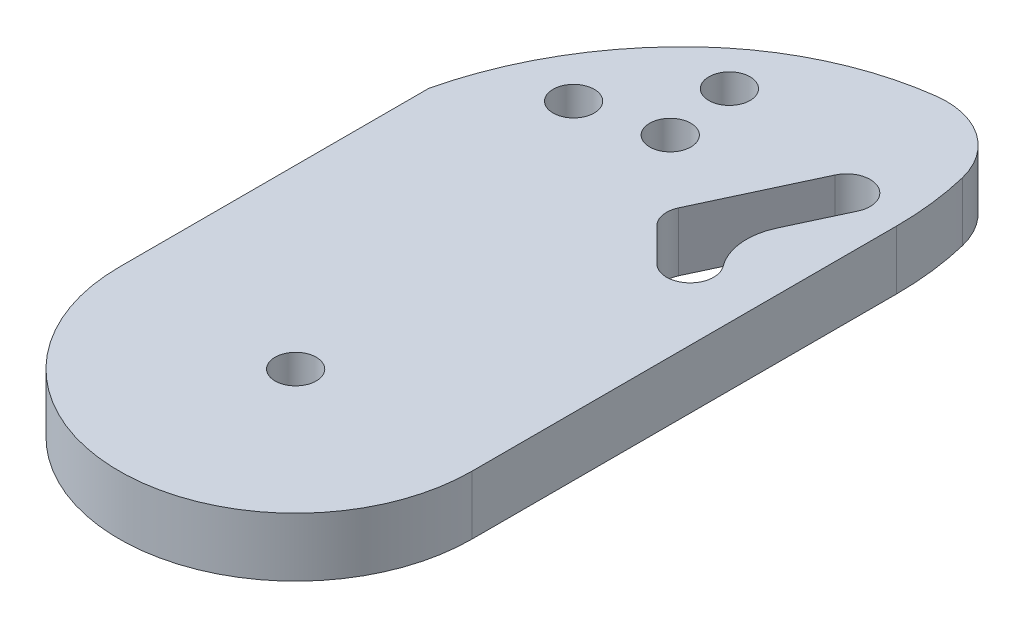
ISO-10303-21;
HEADER;
FILE_DESCRIPTION(('STEP AP214'),'2;1');
FILE_NAME('part.step','',(''),(''),'','','');
FILE_SCHEMA(('AUTOMOTIVE_DESIGN { 1 0 10303 214 1 1 1 1 }'));
ENDSEC;
DATA;
#1=APPLICATION_CONTEXT('core data for automotive mechanical design processes');
#2=APPLICATION_PROTOCOL_DEFINITION('international standard','automotive_design',2000,#1);
#3=PRODUCT_CONTEXT('',#1,'mechanical');
#4=PRODUCT('Part','Part','',(#3));
#5=PRODUCT_RELATED_PRODUCT_CATEGORY('part','',(#4));
#6=PRODUCT_DEFINITION_FORMATION('','',#4);
#7=PRODUCT_DEFINITION_CONTEXT('part definition',#1,'design');
#8=PRODUCT_DEFINITION('design','',#6,#7);
#9=PRODUCT_DEFINITION_SHAPE('','',#8);
#10=(LENGTH_UNIT() NAMED_UNIT(*) SI_UNIT(.MILLI.,.METRE.));
#11=(NAMED_UNIT(*) PLANE_ANGLE_UNIT() SI_UNIT($,.RADIAN.));
#12=(NAMED_UNIT(*) SI_UNIT($,.STERADIAN.) SOLID_ANGLE_UNIT());
#13=UNCERTAINTY_MEASURE_WITH_UNIT(LENGTH_MEASURE(1.E-05),#10,'distance_accuracy_value','');
#14=(GEOMETRIC_REPRESENTATION_CONTEXT(3) GLOBAL_UNCERTAINTY_ASSIGNED_CONTEXT((#13)) GLOBAL_UNIT_ASSIGNED_CONTEXT((#10,
#11,#12)) REPRESENTATION_CONTEXT('',''));
#15=CARTESIAN_POINT('',(0.,0.,0.));
#16=DIRECTION('',(0.,0.,1.));
#17=DIRECTION('',(1.,0.,0.));
#18=AXIS2_PLACEMENT_3D('',#15,#16,#17);
#19=CARTESIAN_POINT('',(0.,5.,0.));
#20=DIRECTION('',(0.,1.,0.));
#21=DIRECTION('',(0.,0.,1.));
#22=AXIS2_PLACEMENT_3D('',#19,#20,#21);
#23=PLANE('',#22);
#24=CARTESIAN_POINT('',(-7.90591950617081,5.,-31.5197648568308));
#25=DIRECTION('',(0.,1.,0.));
#26=DIRECTION('',(0.,0.,1.));
#27=AXIS2_PLACEMENT_3D('',#24,#25,#26);
#28=CIRCLE('',#27,1.75);
#29=CARTESIAN_POINT('',(-7.90591950617081,5.,-29.7697648568308));
#30=VERTEX_POINT('',#29);
#31=EDGE_CURVE('E357',#30,#30,#28,.T.);
#32=ORIENTED_EDGE('',*,*,#31,.F.);
#33=EDGE_LOOP('',(#32));
#34=FACE_BOUND('',#33,.T.);
#35=CARTESIAN_POINT('',(-2.20712771461398,5.,-39.0574093951377));
#36=DIRECTION('',(0.,1.,0.));
#37=DIRECTION('',(0.,0.,1.));
#38=AXIS2_PLACEMENT_3D('',#35,#36,#37);
#39=CIRCLE('',#38,1.75);
#40=CARTESIAN_POINT('',(-2.20712771461398,5.,-37.3074093951377));
#41=VERTEX_POINT('',#40);
#42=EDGE_CURVE('E356',#41,#41,#39,.T.);
#43=ORIENTED_EDGE('',*,*,#42,.F.);
#44=EDGE_LOOP('',(#43));
#45=FACE_BOUND('',#44,.T.);
#46=CARTESIAN_POINT('',(-1.30177895180411,5.,-33.1261073780694));
#47=DIRECTION('',(0.,1.,0.));
#48=DIRECTION('',(0.,0.,1.));
#49=AXIS2_PLACEMENT_3D('',#46,#47,#48);
#50=CIRCLE('',#49,1.75);
#51=CARTESIAN_POINT('',(-1.30177895180411,5.,-31.3761073780694));
#52=VERTEX_POINT('',#51);
#53=EDGE_CURVE('E241',#52,#52,#50,.T.);
#54=ORIENTED_EDGE('',*,*,#53,.F.);
#55=EDGE_LOOP('',(#54));
#56=FACE_BOUND('',#55,.T.);
#57=CARTESIAN_POINT('',(0.,5.,0.));
#58=DIRECTION('',(0.,1.,0.));
#59=DIRECTION('',(0.,0.,1.));
#60=AXIS2_PLACEMENT_3D('',#57,#58,#59);
#61=CIRCLE('',#60,1.75);
#62=CARTESIAN_POINT('',(0.,5.,1.75));
#63=VERTEX_POINT('',#62);
#64=EDGE_CURVE('E171',#63,#63,#61,.T.);
#65=ORIENTED_EDGE('',*,*,#64,.F.);
#66=EDGE_LOOP('',(#65));
#67=FACE_BOUND('',#66,.T.);
#68=DIRECTION('',(-0.422618261740694,0.,0.906307787036653));
#69=VECTOR('',#68,1.);
#70=CARTESIAN_POINT('',(-3.53250443703335,5.,-1.64723387145513));
#71=LINE('',#70,#69);
#72=CARTESIAN_POINT('',(12.2577304500981,5.,-35.5095018633806));
#73=VERTEX_POINT('',#72);
#74=CARTESIAN_POINT('',(10.0710728323983,5.,-30.8201994694383));
#75=VERTEX_POINT('',#74);
#76=EDGE_CURVE('E176',#73,#75,#71,.T.);
#77=ORIENTED_EDGE('',*,*,#76,.T.);
#78=CARTESIAN_POINT('',(14.6026117675815,5.,-28.7071081607348));
#79=DIRECTION('',(0.,1.,0.));
#80=DIRECTION('',(0.,0.,1.));
#81=AXIS2_PLACEMENT_3D('',#78,#79,#80);
#82=CIRCLE('',#81,5.);
#83=CARTESIAN_POINT('',(10.600746219309,5.,-25.7095971710052));
#84=VERTEX_POINT('',#83);
#85=EDGE_CURVE('E228',#75,#84,#82,.T.);
#86=ORIENTED_EDGE('',*,*,#85,.T.);
#87=CARTESIAN_POINT('',(9.,5.,-24.5105927751134));
#88=DIRECTION('',(0.,1.,0.));
#89=DIRECTION('',(0.,0.,1.));
#90=AXIS2_PLACEMENT_3D('',#87,#88,#89);
#91=CIRCLE('',#90,2.);
#92=CARTESIAN_POINT('',(7.58578643762692,5.,-23.0963792127403));
#93=VERTEX_POINT('',#92);
#94=EDGE_CURVE('E208',#93,#84,#91,.T.);
#95=ORIENTED_EDGE('',*,*,#94,.F.);
#96=DIRECTION('',(0.707106781186554,0.,0.707106781186541));
#97=VECTOR('',#96,1.);
#98=CARTESIAN_POINT('',(15.3410828251835,5.,-15.3410828251838));
#99=LINE('',#98,#97);
#100=CARTESIAN_POINT('',(4.8047186962448,5.,-25.8774469541224));
#101=VERTEX_POINT('',#100);
#102=EDGE_CURVE('E319',#101,#93,#99,.T.);
#103=ORIENTED_EDGE('',*,*,#102,.F.);
#104=CARTESIAN_POINT('',(6.21893225861788,5.,-27.2916605164955));
#105=DIRECTION('',(0.,1.,0.));
#106=DIRECTION('',(0.,0.,1.));
#107=AXIS2_PLACEMENT_3D('',#104,#105,#106);
#108=CIRCLE('',#107,2.);
#109=CARTESIAN_POINT('',(4.40631668454458,5.,-28.1368970399769));
#110=VERTEX_POINT('',#109);
#111=EDGE_CURVE('E338',#110,#101,#108,.T.);
#112=ORIENTED_EDGE('',*,*,#111,.F.);
#113=DIRECTION('',(-0.422618261740694,0.,0.906307787036652));
#114=VECTOR('',#113,1.);
#115=CARTESIAN_POINT('',(-7.15773558517998,5.,-3.33770691841793));
#116=LINE('',#115,#114);
#117=CARTESIAN_POINT('',(8.63249930195152,5.,-37.1999749103434));
#118=VERTEX_POINT('',#117);
#119=EDGE_CURVE('E334',#118,#110,#116,.T.);
#120=ORIENTED_EDGE('',*,*,#119,.F.);
#121=CARTESIAN_POINT('',(10.4451148760249,5.,-36.354738386862));
#122=DIRECTION('',(0.,1.,0.));
#123=DIRECTION('',(0.,0.,1.));
#124=AXIS2_PLACEMENT_3D('',#121,#122,#123);
#125=CIRCLE('',#124,2.);
#126=EDGE_CURVE('E329',#73,#118,#125,.T.);
#127=ORIENTED_EDGE('',*,*,#126,.F.);
#128=EDGE_LOOP('',(#77,#86,#95,#103,#112,#120,#127));
#129=FACE_BOUND('',#128,.T.);
#130=CARTESIAN_POINT('',(-12.0433926946577,5.,-36.0469907387137));
#131=DIRECTION('',(0.,-1.,0.));
#132=DIRECTION('',(0.,0.,1.));
#133=AXIS2_PLACEMENT_3D('',#130,#131,#132);
#134=CIRCLE('',#133,27.0433926946577);
#135=CARTESIAN_POINT('',(14.2432435242057,5.,-42.3997731790783));
#136=VERTEX_POINT('',#135);
#137=CARTESIAN_POINT('',(15.,5.,-36.0469907387136));
#138=VERTEX_POINT('',#137);
#139=EDGE_CURVE('E143',#136,#138,#134,.T.);
#140=ORIENTED_EDGE('',*,*,#139,.F.);
#141=CARTESIAN_POINT('',(7.95930078320732,5.,-40.8811109672649));
#142=DIRECTION('',(0.,-1.,0.));
#143=DIRECTION('',(0.,0.,1.));
#144=AXIS2_PLACEMENT_3D('',#141,#142,#143);
#145=CIRCLE('',#144,6.46484889890984);
#146=CARTESIAN_POINT('',(7.1270724023176,5.,-47.2921691644565));
#147=VERTEX_POINT('',#146);
#148=EDGE_CURVE('E164',#147,#136,#145,.T.);
#149=ORIENTED_EDGE('',*,*,#148,.F.);
#150=CARTESIAN_POINT('',(10.3077401020891,5.,-22.789945739485));
#151=DIRECTION('',(0.,-1.,0.));
#152=DIRECTION('',(0.,0.,1.));
#153=AXIS2_PLACEMENT_3D('',#150,#151,#152);
#154=CIRCLE('',#153,24.707804430657);
#155=CARTESIAN_POINT('',(-6.48402665532397,5.,-40.9148503998751));
#156=VERTEX_POINT('',#155);
#157=EDGE_CURVE('E350',#156,#147,#154,.T.);
#158=ORIENTED_EDGE('',*,*,#157,.F.);
#159=CARTESIAN_POINT('',(13.2458473139737,5.,-19.6185752775946));
#160=DIRECTION('',(0.,-1.,0.));
#161=DIRECTION('',(0.,0.,1.));
#162=AXIS2_PLACEMENT_3D('',#159,#160,#161);
#163=CIRCLE('',#162,29.0310051656541);
#164=CARTESIAN_POINT('',(-15.,5.,-26.3246449494605));
#165=VERTEX_POINT('',#164);
#166=EDGE_CURVE('E153',#165,#156,#163,.T.);
#167=ORIENTED_EDGE('',*,*,#166,.F.);
#168=DIRECTION('',(0.,0.,-1.));
#169=VECTOR('',#168,1.);
#170=CARTESIAN_POINT('',(-15.,5.,0.));
#171=LINE('',#170,#169);
#172=CARTESIAN_POINT('',(-15.,5.,0.));
#173=VERTEX_POINT('',#172);
#174=EDGE_CURVE('E170',#173,#165,#171,.T.);
#175=ORIENTED_EDGE('',*,*,#174,.F.);
#176=CARTESIAN_POINT('',(0.,5.,0.));
#177=DIRECTION('',(0.,1.,0.));
#178=DIRECTION('',(0.,0.,1.));
#179=AXIS2_PLACEMENT_3D('',#176,#177,#178);
#180=CIRCLE('',#179,15.);
#181=CARTESIAN_POINT('',(15.,5.,0.));
#182=VERTEX_POINT('',#181);
#183=EDGE_CURVE('E168',#173,#182,#180,.T.);
#184=ORIENTED_EDGE('',*,*,#183,.T.);
#185=DIRECTION('',(0.,0.,-1.));
#186=VECTOR('',#185,1.);
#187=CARTESIAN_POINT('',(15.,5.,0.));
#188=LINE('',#187,#186);
#189=EDGE_CURVE('E160',#182,#138,#188,.T.);
#190=ORIENTED_EDGE('',*,*,#189,.T.);
#191=EDGE_LOOP('',(#140,#149,#158,#167,#175,#184,#190));
#192=FACE_BOUND('',#191,.T.);
#193=ADVANCED_FACE('F39',(#34,#45,#56,#67,#129,#192),#23,.T.);
#194=CARTESIAN_POINT('',(0.,0.,0.));
#195=DIRECTION('',(0.,1.,0.));
#196=DIRECTION('',(0.,0.,1.));
#197=AXIS2_PLACEMENT_3D('',#194,#195,#196);
#198=PLANE('',#197);
#199=CARTESIAN_POINT('',(-7.90591950617081,0.,-31.5197648568308));
#200=DIRECTION('',(0.,1.,0.));
#201=DIRECTION('',(0.,0.,1.));
#202=AXIS2_PLACEMENT_3D('',#199,#200,#201);
#203=CIRCLE('',#202,1.75);
#204=CARTESIAN_POINT('',(-7.90591950617081,0.,-29.7697648568308));
#205=VERTEX_POINT('',#204);
#206=EDGE_CURVE('E43',#205,#205,#203,.T.);
#207=ORIENTED_EDGE('',*,*,#206,.T.);
#208=EDGE_LOOP('',(#207));
#209=FACE_BOUND('',#208,.T.);
#210=CARTESIAN_POINT('',(-2.20712771461398,0.,-39.0574093951377));
#211=DIRECTION('',(0.,1.,0.));
#212=DIRECTION('',(0.,0.,1.));
#213=AXIS2_PLACEMENT_3D('',#210,#211,#212);
#214=CIRCLE('',#213,1.75);
#215=CARTESIAN_POINT('',(-2.20712771461398,0.,-37.3074093951377));
#216=VERTEX_POINT('',#215);
#217=EDGE_CURVE('E240',#216,#216,#214,.T.);
#218=ORIENTED_EDGE('',*,*,#217,.T.);
#219=EDGE_LOOP('',(#218));
#220=FACE_BOUND('',#219,.T.);
#221=CARTESIAN_POINT('',(-1.30177895180411,0.,-33.1261073780694));
#222=DIRECTION('',(0.,1.,0.));
#223=DIRECTION('',(0.,0.,1.));
#224=AXIS2_PLACEMENT_3D('',#221,#222,#223);
#225=CIRCLE('',#224,1.75);
#226=CARTESIAN_POINT('',(-1.30177895180411,0.,-31.3761073780694));
#227=VERTEX_POINT('',#226);
#228=EDGE_CURVE('E238',#227,#227,#225,.T.);
#229=ORIENTED_EDGE('',*,*,#228,.T.);
#230=EDGE_LOOP('',(#229));
#231=FACE_BOUND('',#230,.T.);
#232=CARTESIAN_POINT('',(9.,0.,-24.5105927751134));
#233=DIRECTION('',(0.,1.,0.));
#234=DIRECTION('',(0.,0.,1.));
#235=AXIS2_PLACEMENT_3D('',#232,#233,#234);
#236=CIRCLE('',#235,2.);
#237=CARTESIAN_POINT('',(7.58578643762692,0.,-23.0963792127403));
#238=VERTEX_POINT('',#237);
#239=CARTESIAN_POINT('',(10.600746219309,0.,-25.7095971710052));
#240=VERTEX_POINT('',#239);
#241=EDGE_CURVE('E182',#238,#240,#236,.T.);
#242=ORIENTED_EDGE('',*,*,#241,.T.);
#243=CARTESIAN_POINT('',(14.6026117675815,0.,-28.7071081607348));
#244=DIRECTION('',(0.,1.,0.));
#245=DIRECTION('',(0.,0.,1.));
#246=AXIS2_PLACEMENT_3D('',#243,#244,#245);
#247=CIRCLE('',#246,5.);
#248=CARTESIAN_POINT('',(10.0710728323983,0.,-30.8201994694383));
#249=VERTEX_POINT('',#248);
#250=EDGE_CURVE('E225',#240,#249,#247,.F.);
#251=ORIENTED_EDGE('',*,*,#250,.T.);
#252=DIRECTION('',(-0.422618261740694,0.,0.906307787036653));
#253=VECTOR('',#252,1.);
#254=CARTESIAN_POINT('',(-3.53250443703335,0.,-1.64723387145513));
#255=LINE('',#254,#253);
#256=CARTESIAN_POINT('',(12.2577304500981,0.,-35.5095018633806));
#257=VERTEX_POINT('',#256);
#258=EDGE_CURVE('E197',#257,#249,#255,.T.);
#259=ORIENTED_EDGE('',*,*,#258,.F.);
#260=CARTESIAN_POINT('',(10.4451148760249,0.,-36.354738386862));
#261=DIRECTION('',(0.,1.,0.));
#262=DIRECTION('',(0.,0.,1.));
#263=AXIS2_PLACEMENT_3D('',#260,#261,#262);
#264=CIRCLE('',#263,2.);
#265=CARTESIAN_POINT('',(8.63249930195152,0.,-37.1999749103434));
#266=VERTEX_POINT('',#265);
#267=EDGE_CURVE('E194',#257,#266,#264,.T.);
#268=ORIENTED_EDGE('',*,*,#267,.T.);
#269=DIRECTION('',(-0.422618261740694,0.,0.906307787036652));
#270=VECTOR('',#269,1.);
#271=CARTESIAN_POINT('',(-7.15773558517998,0.,-3.33770691841793));
#272=LINE('',#271,#270);
#273=CARTESIAN_POINT('',(4.40631668454458,0.,-28.1368970399769));
#274=VERTEX_POINT('',#273);
#275=EDGE_CURVE('E191',#266,#274,#272,.T.);
#276=ORIENTED_EDGE('',*,*,#275,.T.);
#277=CARTESIAN_POINT('',(6.21893225861788,0.,-27.2916605164955));
#278=DIRECTION('',(0.,1.,0.));
#279=DIRECTION('',(0.,0.,1.));
#280=AXIS2_PLACEMENT_3D('',#277,#278,#279);
#281=CIRCLE('',#280,2.);
#282=CARTESIAN_POINT('',(4.8047186962448,0.,-25.8774469541224));
#283=VERTEX_POINT('',#282);
#284=EDGE_CURVE('E188',#274,#283,#281,.T.);
#285=ORIENTED_EDGE('',*,*,#284,.T.);
#286=DIRECTION('',(0.707106781186554,0.,0.707106781186541));
#287=VECTOR('',#286,1.);
#288=CARTESIAN_POINT('',(15.3410828251835,0.,-15.3410828251838));
#289=LINE('',#288,#287);
#290=EDGE_CURVE('E185',#283,#238,#289,.T.);
#291=ORIENTED_EDGE('',*,*,#290,.T.);
#292=EDGE_LOOP('',(#242,#251,#259,#268,#276,#285,#291));
#293=FACE_BOUND('',#292,.T.);
#294=CARTESIAN_POINT('',(0.,0.,0.));
#295=DIRECTION('',(0.,1.,0.));
#296=DIRECTION('',(0.,0.,1.));
#297=AXIS2_PLACEMENT_3D('',#294,#295,#296);
#298=CIRCLE('',#297,1.75);
#299=CARTESIAN_POINT('',(0.,0.,1.75));
#300=VERTEX_POINT('',#299);
#301=EDGE_CURVE('E199',#300,#300,#298,.T.);
#302=ORIENTED_EDGE('',*,*,#301,.T.);
#303=EDGE_LOOP('',(#302));
#304=FACE_BOUND('',#303,.T.);
#305=CARTESIAN_POINT('',(7.95930078320732,0.,-40.8811109672649));
#306=DIRECTION('',(0.,1.,0.));
#307=DIRECTION('',(0.,0.,1.));
#308=AXIS2_PLACEMENT_3D('',#305,#306,#307);
#309=CIRCLE('',#308,6.46484889890984);
#310=CARTESIAN_POINT('',(7.1270724023176,0.,-47.2921691644565));
#311=VERTEX_POINT('',#310);
#312=CARTESIAN_POINT('',(14.2432435242057,0.,-42.3997731790783));
#313=VERTEX_POINT('',#312);
#314=EDGE_CURVE('E48',#311,#313,#309,.F.);
#315=ORIENTED_EDGE('',*,*,#314,.T.);
#316=CARTESIAN_POINT('',(-12.0433926946577,0.,-36.0469907387137));
#317=DIRECTION('',(0.,1.,0.));
#318=DIRECTION('',(0.,0.,1.));
#319=AXIS2_PLACEMENT_3D('',#316,#317,#318);
#320=CIRCLE('',#319,27.0433926946577);
#321=CARTESIAN_POINT('',(15.,0.,-36.0469907387136));
#322=VERTEX_POINT('',#321);
#323=EDGE_CURVE('E11',#313,#322,#320,.F.);
#324=ORIENTED_EDGE('',*,*,#323,.T.);
#325=DIRECTION('',(0.,0.,-1.));
#326=VECTOR('',#325,1.);
#327=CARTESIAN_POINT('',(15.,0.,0.));
#328=LINE('',#327,#326);
#329=CARTESIAN_POINT('',(15.,0.,0.));
#330=VERTEX_POINT('',#329);
#331=EDGE_CURVE('E162',#330,#322,#328,.T.);
#332=ORIENTED_EDGE('',*,*,#331,.F.);
#333=CARTESIAN_POINT('',(0.,0.,0.));
#334=DIRECTION('',(0.,1.,0.));
#335=DIRECTION('',(0.,0.,1.));
#336=AXIS2_PLACEMENT_3D('',#333,#334,#335);
#337=CIRCLE('',#336,15.);
#338=CARTESIAN_POINT('',(-15.,0.,0.));
#339=VERTEX_POINT('',#338);
#340=EDGE_CURVE('E206',#339,#330,#337,.T.);
#341=ORIENTED_EDGE('',*,*,#340,.F.);
#342=DIRECTION('',(0.,0.,-1.));
#343=VECTOR('',#342,1.);
#344=CARTESIAN_POINT('',(-15.,0.,0.));
#345=LINE('',#344,#343);
#346=CARTESIAN_POINT('',(-15.,0.,-26.3246449494605));
#347=VERTEX_POINT('',#346);
#348=EDGE_CURVE('E203',#339,#347,#345,.T.);
#349=ORIENTED_EDGE('',*,*,#348,.T.);
#350=CARTESIAN_POINT('',(13.2458473139737,0.,-19.6185752775946));
#351=DIRECTION('',(0.,1.,0.));
#352=DIRECTION('',(0.,0.,1.));
#353=AXIS2_PLACEMENT_3D('',#350,#351,#352);
#354=CIRCLE('',#353,29.0310051656541);
#355=CARTESIAN_POINT('',(-6.48402665532398,0.,-40.9148503998751));
#356=VERTEX_POINT('',#355);
#357=EDGE_CURVE('E230',#347,#356,#354,.F.);
#358=ORIENTED_EDGE('',*,*,#357,.T.);
#359=CARTESIAN_POINT('',(10.3077401020891,0.,-22.789945739485));
#360=DIRECTION('',(0.,1.,0.));
#361=DIRECTION('',(0.,0.,1.));
#362=AXIS2_PLACEMENT_3D('',#359,#360,#361);
#363=CIRCLE('',#362,24.707804430657);
#364=EDGE_CURVE('E233',#356,#311,#363,.F.);
#365=ORIENTED_EDGE('',*,*,#364,.T.);
#366=EDGE_LOOP('',(#315,#324,#332,#341,#349,#358,#365));
#367=FACE_BOUND('',#366,.T.);
#368=ADVANCED_FACE('F248',(#209,#220,#231,#293,#304,#367),#198,.F.);
#369=CARTESIAN_POINT('',(15.,5.,0.));
#370=DIRECTION('',(-1.,0.,0.));
#371=DIRECTION('',(0.,0.,1.));
#372=AXIS2_PLACEMENT_3D('',#369,#370,#371);
#373=PLANE('',#372);
#374=ORIENTED_EDGE('',*,*,#331,.T.);
#375=DIRECTION('',(0.,1.,0.));
#376=VECTOR('',#375,1.);
#377=CARTESIAN_POINT('',(15.,-5.,-36.0469907387136));
#378=LINE('',#377,#376);
#379=EDGE_CURVE('E146',#322,#138,#378,.T.);
#380=ORIENTED_EDGE('',*,*,#379,.T.);
#381=ORIENTED_EDGE('',*,*,#189,.F.);
#382=DIRECTION('',(0.,-1.,0.));
#383=VECTOR('',#382,1.);
#384=CARTESIAN_POINT('',(15.,5.,0.));
#385=LINE('',#384,#383);
#386=EDGE_CURVE('E209',#182,#330,#385,.T.);
#387=ORIENTED_EDGE('',*,*,#386,.T.);
#388=EDGE_LOOP('',(#374,#380,#381,#387));
#389=FACE_BOUND('',#388,.T.);
#390=ADVANCED_FACE('F158',(#389),#373,.F.);
#391=CARTESIAN_POINT('',(-15.,5.,0.));
#392=DIRECTION('',(-1.,0.,0.));
#393=DIRECTION('',(0.,0.,1.));
#394=AXIS2_PLACEMENT_3D('',#391,#392,#393);
#395=PLANE('',#394);
#396=DIRECTION('',(0.,1.,0.));
#397=VECTOR('',#396,1.);
#398=CARTESIAN_POINT('',(-15.,-5.,-26.3246449494605));
#399=LINE('',#398,#397);
#400=EDGE_CURVE('E163',#347,#165,#399,.T.);
#401=ORIENTED_EDGE('',*,*,#400,.F.);
#402=ORIENTED_EDGE('',*,*,#348,.F.);
#403=DIRECTION('',(0.,-1.,0.));
#404=VECTOR('',#403,1.);
#405=CARTESIAN_POINT('',(-15.,5.,0.));
#406=LINE('',#405,#404);
#407=EDGE_CURVE('E211',#173,#339,#406,.T.);
#408=ORIENTED_EDGE('',*,*,#407,.F.);
#409=ORIENTED_EDGE('',*,*,#174,.T.);
#410=EDGE_LOOP('',(#401,#402,#408,#409));
#411=FACE_BOUND('',#410,.T.);
#412=ADVANCED_FACE('F280',(#411),#395,.T.);
#413=CARTESIAN_POINT('',(9.,5.,-24.5105927751134));
#414=DIRECTION('',(0.,-1.,0.));
#415=DIRECTION('',(0.,0.,-1.));
#416=AXIS2_PLACEMENT_3D('',#413,#414,#415);
#417=CYLINDRICAL_SURFACE('',#416,2.);
#418=ORIENTED_EDGE('',*,*,#94,.T.);
#419=DIRECTION('',(0.,-1.,0.));
#420=VECTOR('',#419,1.);
#421=CARTESIAN_POINT('',(10.600746219309,5.,-25.7095971710052));
#422=LINE('',#421,#420);
#423=EDGE_CURVE('E214',#84,#240,#422,.T.);
#424=ORIENTED_EDGE('',*,*,#423,.T.);
#425=ORIENTED_EDGE('',*,*,#241,.F.);
#426=DIRECTION('',(0.,-1.,0.));
#427=VECTOR('',#426,1.);
#428=CARTESIAN_POINT('',(7.58578643762692,5.,-23.0963792127403));
#429=LINE('',#428,#427);
#430=EDGE_CURVE('E212',#93,#238,#429,.T.);
#431=ORIENTED_EDGE('',*,*,#430,.F.);
#432=EDGE_LOOP('',(#418,#424,#425,#431));
#433=FACE_BOUND('',#432,.T.);
#434=ADVANCED_FACE('F283',(#433),#417,.F.);
#435=CARTESIAN_POINT('',(15.3410828251835,5.,-15.3410828251838));
#436=DIRECTION('',(0.707106781186541,0.,-0.707106781186554));
#437=DIRECTION('',(-0.707106781186554,0.,-0.707106781186541));
#438=AXIS2_PLACEMENT_3D('',#435,#436,#437);
#439=PLANE('',#438);
#440=ORIENTED_EDGE('',*,*,#290,.F.);
#441=DIRECTION('',(0.,-1.,0.));
#442=VECTOR('',#441,1.);
#443=CARTESIAN_POINT('',(4.8047186962448,5.,-25.8774469541224));
#444=LINE('',#443,#442);
#445=EDGE_CURVE('E220',#101,#283,#444,.T.);
#446=ORIENTED_EDGE('',*,*,#445,.F.);
#447=ORIENTED_EDGE('',*,*,#102,.T.);
#448=ORIENTED_EDGE('',*,*,#430,.T.);
#449=EDGE_LOOP('',(#440,#446,#447,#448));
#450=FACE_BOUND('',#449,.T.);
#451=ADVANCED_FACE('F304',(#450),#439,.T.);
#452=CARTESIAN_POINT('',(6.21893225861788,5.,-27.2916605164955));
#453=DIRECTION('',(0.,-1.,0.));
#454=DIRECTION('',(0.,0.,-1.));
#455=AXIS2_PLACEMENT_3D('',#452,#453,#454);
#456=CYLINDRICAL_SURFACE('',#455,2.);
#457=ORIENTED_EDGE('',*,*,#284,.F.);
#458=DIRECTION('',(0.,-1.,0.));
#459=VECTOR('',#458,1.);
#460=CARTESIAN_POINT('',(4.40631668454458,5.,-28.1368970399769));
#461=LINE('',#460,#459);
#462=EDGE_CURVE('E218',#110,#274,#461,.T.);
#463=ORIENTED_EDGE('',*,*,#462,.F.);
#464=ORIENTED_EDGE('',*,*,#111,.T.);
#465=ORIENTED_EDGE('',*,*,#445,.T.);
#466=EDGE_LOOP('',(#457,#463,#464,#465));
#467=FACE_BOUND('',#466,.T.);
#468=ADVANCED_FACE('F300',(#467),#456,.F.);
#469=CARTESIAN_POINT('',(-7.15773558517998,5.,-3.33770691841793));
#470=DIRECTION('',(0.906307787036652,0.,0.422618261740694));
#471=DIRECTION('',(0.422618261740694,0.,-0.906307787036652));
#472=AXIS2_PLACEMENT_3D('',#469,#470,#471);
#473=PLANE('',#472);
#474=ORIENTED_EDGE('',*,*,#275,.F.);
#475=DIRECTION('',(0.,-1.,0.));
#476=VECTOR('',#475,1.);
#477=CARTESIAN_POINT('',(8.63249930195152,5.,-37.1999749103434));
#478=LINE('',#477,#476);
#479=EDGE_CURVE('E216',#118,#266,#478,.T.);
#480=ORIENTED_EDGE('',*,*,#479,.F.);
#481=ORIENTED_EDGE('',*,*,#119,.T.);
#482=ORIENTED_EDGE('',*,*,#462,.T.);
#483=EDGE_LOOP('',(#474,#480,#481,#482));
#484=FACE_BOUND('',#483,.T.);
#485=ADVANCED_FACE('F296',(#484),#473,.T.);
#486=CARTESIAN_POINT('',(10.4451148760249,5.,-36.354738386862));
#487=DIRECTION('',(0.,-1.,0.));
#488=DIRECTION('',(0.,0.,-1.));
#489=AXIS2_PLACEMENT_3D('',#486,#487,#488);
#490=CYLINDRICAL_SURFACE('',#489,2.);
#491=ORIENTED_EDGE('',*,*,#267,.F.);
#492=DIRECTION('',(0.,-1.,0.));
#493=VECTOR('',#492,1.);
#494=CARTESIAN_POINT('',(12.2577304500981,5.,-35.5095018633806));
#495=LINE('',#494,#493);
#496=EDGE_CURVE('E181',#73,#257,#495,.T.);
#497=ORIENTED_EDGE('',*,*,#496,.F.);
#498=ORIENTED_EDGE('',*,*,#126,.T.);
#499=ORIENTED_EDGE('',*,*,#479,.T.);
#500=EDGE_LOOP('',(#491,#497,#498,#499));
#501=FACE_BOUND('',#500,.T.);
#502=ADVANCED_FACE('F293',(#501),#490,.F.);
#503=CARTESIAN_POINT('',(-3.53250443703335,5.,-1.64723387145513));
#504=DIRECTION('',(0.906307787036653,0.,0.422618261740694));
#505=DIRECTION('',(0.422618261740694,0.,-0.906307787036653));
#506=AXIS2_PLACEMENT_3D('',#503,#504,#505);
#507=PLANE('',#506);
#508=ORIENTED_EDGE('',*,*,#258,.T.);
#509=DIRECTION('',(0.,1.,0.));
#510=VECTOR('',#509,1.);
#511=CARTESIAN_POINT('',(10.0710728323983,5.,-30.8201994694383));
#512=LINE('',#511,#510);
#513=EDGE_CURVE('E64',#249,#75,#512,.T.);
#514=ORIENTED_EDGE('',*,*,#513,.T.);
#515=ORIENTED_EDGE('',*,*,#76,.F.);
#516=ORIENTED_EDGE('',*,*,#496,.T.);
#517=EDGE_LOOP('',(#508,#514,#515,#516));
#518=FACE_BOUND('',#517,.T.);
#519=ADVANCED_FACE('F289',(#518),#507,.F.);
#520=CARTESIAN_POINT('',(0.,5.,0.));
#521=DIRECTION('',(0.,-1.,0.));
#522=DIRECTION('',(0.,0.,-1.));
#523=AXIS2_PLACEMENT_3D('',#520,#521,#522);
#524=CYLINDRICAL_SURFACE('',#523,1.75);
#525=ORIENTED_EDGE('',*,*,#64,.T.);
#526=EDGE_LOOP('',(#525));
#527=FACE_BOUND('',#526,.T.);
#528=ORIENTED_EDGE('',*,*,#301,.F.);
#529=EDGE_LOOP('',(#528));
#530=FACE_BOUND('',#529,.T.);
#531=ADVANCED_FACE('F278',(#527,#530),#524,.F.);
#532=CARTESIAN_POINT('',(0.,5.,0.));
#533=DIRECTION('',(0.,-1.,0.));
#534=DIRECTION('',(0.,0.,-1.));
#535=AXIS2_PLACEMENT_3D('',#532,#533,#534);
#536=CYLINDRICAL_SURFACE('',#535,15.);
#537=ORIENTED_EDGE('',*,*,#340,.T.);
#538=ORIENTED_EDGE('',*,*,#386,.F.);
#539=ORIENTED_EDGE('',*,*,#183,.F.);
#540=ORIENTED_EDGE('',*,*,#407,.T.);
#541=EDGE_LOOP('',(#537,#538,#539,#540));
#542=FACE_BOUND('',#541,.T.);
#543=ADVANCED_FACE('F275',(#542),#536,.T.);
#544=CARTESIAN_POINT('',(14.6026117675815,5.,-28.7071081607348));
#545=DIRECTION('',(0.,-1.,0.));
#546=DIRECTION('',(0.,0.,-1.));
#547=AXIS2_PLACEMENT_3D('',#544,#545,#546);
#548=CYLINDRICAL_SURFACE('',#547,5.);
#549=ORIENTED_EDGE('',*,*,#85,.F.);
#550=ORIENTED_EDGE('',*,*,#513,.F.);
#551=ORIENTED_EDGE('',*,*,#250,.F.);
#552=ORIENTED_EDGE('',*,*,#423,.F.);
#553=EDGE_LOOP('',(#549,#550,#551,#552));
#554=FACE_BOUND('',#553,.T.);
#555=ADVANCED_FACE('F41',(#554),#548,.T.);
#556=CARTESIAN_POINT('',(-12.0433926946577,-5.,-36.0469907387137));
#557=DIRECTION('',(0.,1.,0.));
#558=DIRECTION('',(0.,0.,1.));
#559=AXIS2_PLACEMENT_3D('',#556,#557,#558);
#560=CYLINDRICAL_SURFACE('',#559,27.0433926946577);
#561=DIRECTION('',(0.,1.,0.));
#562=VECTOR('',#561,1.);
#563=CARTESIAN_POINT('',(14.2432435242057,-5.,-42.3997731790783));
#564=LINE('',#563,#562);
#565=EDGE_CURVE('E148',#313,#136,#564,.T.);
#566=ORIENTED_EDGE('',*,*,#565,.T.);
#567=ORIENTED_EDGE('',*,*,#139,.T.);
#568=ORIENTED_EDGE('',*,*,#379,.F.);
#569=ORIENTED_EDGE('',*,*,#323,.F.);
#570=EDGE_LOOP('',(#566,#567,#568,#569));
#571=FACE_BOUND('',#570,.T.);
#572=ADVANCED_FACE('F145',(#571),#560,.T.);
#573=CARTESIAN_POINT('',(7.95930078320732,-5.,-40.8811109672649));
#574=DIRECTION('',(0.,1.,0.));
#575=DIRECTION('',(0.,0.,1.));
#576=AXIS2_PLACEMENT_3D('',#573,#574,#575);
#577=CYLINDRICAL_SURFACE('',#576,6.46484889890984);
#578=DIRECTION('',(0.,1.,0.));
#579=VECTOR('',#578,1.);
#580=CARTESIAN_POINT('',(7.1270724023176,-5.,-47.2921691644565));
#581=LINE('',#580,#579);
#582=EDGE_CURVE('E346',#311,#147,#581,.T.);
#583=ORIENTED_EDGE('',*,*,#582,.T.);
#584=ORIENTED_EDGE('',*,*,#148,.T.);
#585=ORIENTED_EDGE('',*,*,#565,.F.);
#586=ORIENTED_EDGE('',*,*,#314,.F.);
#587=EDGE_LOOP('',(#583,#584,#585,#586));
#588=FACE_BOUND('',#587,.T.);
#589=ADVANCED_FACE('F371',(#588),#577,.T.);
#590=CARTESIAN_POINT('',(10.3077401020891,-5.,-22.789945739485));
#591=DIRECTION('',(0.,1.,0.));
#592=DIRECTION('',(0.,0.,1.));
#593=AXIS2_PLACEMENT_3D('',#590,#591,#592);
#594=CYLINDRICAL_SURFACE('',#593,24.707804430657);
#595=DIRECTION('',(0.,1.,0.));
#596=VECTOR('',#595,1.);
#597=CARTESIAN_POINT('',(-6.48402665532397,-5.,-40.9148503998751));
#598=LINE('',#597,#596);
#599=EDGE_CURVE('E56',#356,#156,#598,.T.);
#600=ORIENTED_EDGE('',*,*,#599,.T.);
#601=ORIENTED_EDGE('',*,*,#157,.T.);
#602=ORIENTED_EDGE('',*,*,#582,.F.);
#603=ORIENTED_EDGE('',*,*,#364,.F.);
#604=EDGE_LOOP('',(#600,#601,#602,#603));
#605=FACE_BOUND('',#604,.T.);
#606=ADVANCED_FACE('F373',(#605),#594,.T.);
#607=CARTESIAN_POINT('',(13.2458473139737,-5.,-19.6185752775946));
#608=DIRECTION('',(0.,1.,0.));
#609=DIRECTION('',(0.,0.,1.));
#610=AXIS2_PLACEMENT_3D('',#607,#608,#609);
#611=CYLINDRICAL_SURFACE('',#610,29.0310051656541);
#612=ORIENTED_EDGE('',*,*,#400,.T.);
#613=ORIENTED_EDGE('',*,*,#166,.T.);
#614=ORIENTED_EDGE('',*,*,#599,.F.);
#615=ORIENTED_EDGE('',*,*,#357,.F.);
#616=EDGE_LOOP('',(#612,#613,#614,#615));
#617=FACE_BOUND('',#616,.T.);
#618=ADVANCED_FACE('F379',(#617),#611,.T.);
#619=CARTESIAN_POINT('',(-1.30177895180411,-5.,-33.1261073780694));
#620=DIRECTION('',(0.,1.,0.));
#621=DIRECTION('',(0.,0.,1.));
#622=AXIS2_PLACEMENT_3D('',#619,#620,#621);
#623=CYLINDRICAL_SURFACE('',#622,1.75);
#624=ORIENTED_EDGE('',*,*,#53,.T.);
#625=EDGE_LOOP('',(#624));
#626=FACE_BOUND('',#625,.T.);
#627=ORIENTED_EDGE('',*,*,#228,.F.);
#628=EDGE_LOOP('',(#627));
#629=FACE_BOUND('',#628,.T.);
#630=ADVANCED_FACE('F258',(#626,#629),#623,.F.);
#631=CARTESIAN_POINT('',(-2.20712771461398,-5.,-39.0574093951377));
#632=DIRECTION('',(0.,1.,0.));
#633=DIRECTION('',(0.,0.,1.));
#634=AXIS2_PLACEMENT_3D('',#631,#632,#633);
#635=CYLINDRICAL_SURFACE('',#634,1.75);
#636=ORIENTED_EDGE('',*,*,#42,.T.);
#637=EDGE_LOOP('',(#636));
#638=FACE_BOUND('',#637,.T.);
#639=ORIENTED_EDGE('',*,*,#217,.F.);
#640=EDGE_LOOP('',(#639));
#641=FACE_BOUND('',#640,.T.);
#642=ADVANCED_FACE('F252',(#638,#641),#635,.F.);
#643=CARTESIAN_POINT('',(-7.90591950617081,-5.,-31.5197648568308));
#644=DIRECTION('',(0.,1.,0.));
#645=DIRECTION('',(0.,0.,1.));
#646=AXIS2_PLACEMENT_3D('',#643,#644,#645);
#647=CYLINDRICAL_SURFACE('',#646,1.75);
#648=ORIENTED_EDGE('',*,*,#31,.T.);
#649=EDGE_LOOP('',(#648));
#650=FACE_BOUND('',#649,.T.);
#651=ORIENTED_EDGE('',*,*,#206,.F.);
#652=EDGE_LOOP('',(#651));
#653=FACE_BOUND('',#652,.T.);
#654=ADVANCED_FACE('F250',(#650,#653),#647,.F.);
#655=CLOSED_SHELL('',(#193,#368,#390,#412,#434,#451,#468,#485,#502,#519,#531,#543,#555,#572,
#589,#606,#618,#630,#642,#654));
#656=MANIFOLD_SOLID_BREP('B2',#655);
#657=ADVANCED_BREP_SHAPE_REPRESENTATION('',(#18,#656),#14);
#658=SHAPE_DEFINITION_REPRESENTATION(#9,#657);
ENDSEC;
END-ISO-10303-21;
